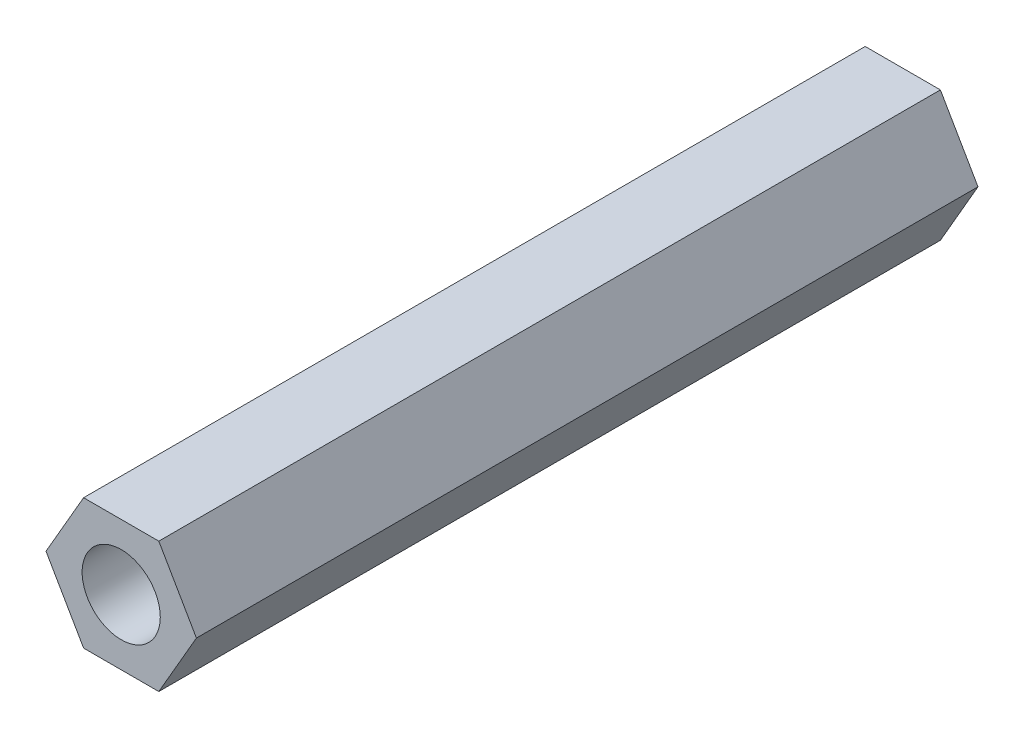
ISO-10303-21;
HEADER;
FILE_DESCRIPTION(('STEP AP214'),'2;1');
FILE_NAME('part.step','',(''),(''),'','','');
FILE_SCHEMA(('AUTOMOTIVE_DESIGN { 1 0 10303 214 1 1 1 1 }'));
ENDSEC;
DATA;
#1=APPLICATION_CONTEXT('core data for automotive mechanical design processes');
#2=APPLICATION_PROTOCOL_DEFINITION('international standard','automotive_design',2000,#1);
#3=PRODUCT_CONTEXT('',#1,'mechanical');
#4=PRODUCT('Part','Part','',(#3));
#5=PRODUCT_RELATED_PRODUCT_CATEGORY('part','',(#4));
#6=PRODUCT_DEFINITION_FORMATION('','',#4);
#7=PRODUCT_DEFINITION_CONTEXT('part definition',#1,'design');
#8=PRODUCT_DEFINITION('design','',#6,#7);
#9=PRODUCT_DEFINITION_SHAPE('','',#8);
#10=(LENGTH_UNIT() NAMED_UNIT(*) SI_UNIT(.MILLI.,.METRE.));
#11=(NAMED_UNIT(*) PLANE_ANGLE_UNIT() SI_UNIT($,.RADIAN.));
#12=(NAMED_UNIT(*) SI_UNIT($,.STERADIAN.) SOLID_ANGLE_UNIT());
#13=UNCERTAINTY_MEASURE_WITH_UNIT(LENGTH_MEASURE(1.E-05),#10,'distance_accuracy_value','');
#14=(GEOMETRIC_REPRESENTATION_CONTEXT(3) GLOBAL_UNCERTAINTY_ASSIGNED_CONTEXT((#13)) GLOBAL_UNIT_ASSIGNED_CONTEXT((#10,
#11,#12)) REPRESENTATION_CONTEXT('',''));
#15=CARTESIAN_POINT('',(0.,0.,0.));
#16=DIRECTION('',(0.,0.,1.));
#17=DIRECTION('',(1.,0.,0.));
#18=AXIS2_PLACEMENT_3D('',#15,#16,#17);
#19=CARTESIAN_POINT('',(0.,0.,30.));
#20=DIRECTION('',(0.,0.,1.));
#21=DIRECTION('',(1.,0.,0.));
#22=AXIS2_PLACEMENT_3D('',#19,#20,#21);
#23=PLANE('',#22);
#24=DIRECTION('',(1.,0.,0.));
#25=VECTOR('',#24,1.);
#26=CARTESIAN_POINT('',(-1.44337567297406,-2.5,30.));
#27=LINE('',#26,#25);
#28=CARTESIAN_POINT('',(-1.44337567297406,-2.5,30.));
#29=VERTEX_POINT('',#28);
#30=CARTESIAN_POINT('',(1.44337567297406,-2.5,30.));
#31=VERTEX_POINT('',#30);
#32=EDGE_CURVE('E131',#29,#31,#27,.T.);
#33=ORIENTED_EDGE('',*,*,#32,.T.);
#34=DIRECTION('',(0.5,0.866025403784439,0.));
#35=VECTOR('',#34,1.);
#36=CARTESIAN_POINT('',(1.44337567297406,-2.5,30.));
#37=LINE('',#36,#35);
#38=CARTESIAN_POINT('',(2.88675134594813,0.,30.));
#39=VERTEX_POINT('',#38);
#40=EDGE_CURVE('E89',#31,#39,#37,.T.);
#41=ORIENTED_EDGE('',*,*,#40,.T.);
#42=DIRECTION('',(-0.5,0.866025403784439,0.));
#43=VECTOR('',#42,1.);
#44=CARTESIAN_POINT('',(2.88675134594813,0.,30.));
#45=LINE('',#44,#43);
#46=CARTESIAN_POINT('',(1.44337567297407,2.5,30.));
#47=VERTEX_POINT('',#46);
#48=EDGE_CURVE('E102',#39,#47,#45,.T.);
#49=ORIENTED_EDGE('',*,*,#48,.T.);
#50=DIRECTION('',(-1.,0.,0.));
#51=VECTOR('',#50,1.);
#52=CARTESIAN_POINT('',(1.44337567297407,2.5,30.));
#53=LINE('',#52,#51);
#54=CARTESIAN_POINT('',(-1.44337567297406,2.5,30.));
#55=VERTEX_POINT('',#54);
#56=EDGE_CURVE('E96',#47,#55,#53,.T.);
#57=ORIENTED_EDGE('',*,*,#56,.T.);
#58=DIRECTION('',(-0.5,-0.866025403784439,0.));
#59=VECTOR('',#58,1.);
#60=CARTESIAN_POINT('',(-1.44337567297406,2.5,30.));
#61=LINE('',#60,#59);
#62=CARTESIAN_POINT('',(-2.88675134594813,0.,30.));
#63=VERTEX_POINT('',#62);
#64=EDGE_CURVE('E100',#55,#63,#61,.T.);
#65=ORIENTED_EDGE('',*,*,#64,.T.);
#66=DIRECTION('',(0.5,-0.866025403784439,0.));
#67=VECTOR('',#66,1.);
#68=CARTESIAN_POINT('',(-2.88675134594813,0.,30.));
#69=LINE('',#68,#67);
#70=EDGE_CURVE('E52',#63,#29,#69,.T.);
#71=ORIENTED_EDGE('',*,*,#70,.T.);
#72=EDGE_LOOP('',(#33,#41,#49,#57,#65,#71));
#73=FACE_BOUND('',#72,.T.);
#74=CARTESIAN_POINT('',(0.,0.,30.));
#75=DIRECTION('',(0.,0.,1.));
#76=DIRECTION('',(1.,0.,0.));
#77=AXIS2_PLACEMENT_3D('',#74,#75,#76);
#78=CIRCLE('',#77,1.5);
#79=CARTESIAN_POINT('',(1.5,0.,30.));
#80=VERTEX_POINT('',#79);
#81=EDGE_CURVE('E124',#80,#80,#78,.T.);
#82=ORIENTED_EDGE('',*,*,#81,.F.);
#83=EDGE_LOOP('',(#82));
#84=FACE_BOUND('',#83,.T.);
#85=ADVANCED_FACE('F35',(#73,#84),#23,.T.);
#86=CARTESIAN_POINT('',(0.,0.,0.));
#87=DIRECTION('',(0.,0.,1.));
#88=DIRECTION('',(1.,0.,0.));
#89=AXIS2_PLACEMENT_3D('',#86,#87,#88);
#90=PLANE('',#89);
#91=DIRECTION('',(1.,0.,0.));
#92=VECTOR('',#91,1.);
#93=CARTESIAN_POINT('',(-1.44337567297406,-2.5,0.));
#94=LINE('',#93,#92);
#95=CARTESIAN_POINT('',(-1.44337567297406,-2.5,0.));
#96=VERTEX_POINT('',#95);
#97=CARTESIAN_POINT('',(1.44337567297406,-2.5,0.));
#98=VERTEX_POINT('',#97);
#99=EDGE_CURVE('E120',#96,#98,#94,.T.);
#100=ORIENTED_EDGE('',*,*,#99,.F.);
#101=DIRECTION('',(0.5,-0.866025403784439,0.));
#102=VECTOR('',#101,1.);
#103=CARTESIAN_POINT('',(-2.88675134594813,0.,0.));
#104=LINE('',#103,#102);
#105=CARTESIAN_POINT('',(-2.88675134594813,0.,0.));
#106=VERTEX_POINT('',#105);
#107=EDGE_CURVE('E81',#106,#96,#104,.T.);
#108=ORIENTED_EDGE('',*,*,#107,.F.);
#109=DIRECTION('',(-0.5,-0.866025403784439,0.));
#110=VECTOR('',#109,1.);
#111=CARTESIAN_POINT('',(-1.44337567297406,2.5,0.));
#112=LINE('',#111,#110);
#113=CARTESIAN_POINT('',(-1.44337567297406,2.5,0.));
#114=VERTEX_POINT('',#113);
#115=EDGE_CURVE('E75',#114,#106,#112,.T.);
#116=ORIENTED_EDGE('',*,*,#115,.F.);
#117=DIRECTION('',(-1.,0.,0.));
#118=VECTOR('',#117,1.);
#119=CARTESIAN_POINT('',(1.44337567297407,2.5,0.));
#120=LINE('',#119,#118);
#121=CARTESIAN_POINT('',(1.44337567297407,2.5,0.));
#122=VERTEX_POINT('',#121);
#123=EDGE_CURVE('E110',#122,#114,#120,.T.);
#124=ORIENTED_EDGE('',*,*,#123,.F.);
#125=DIRECTION('',(-0.5,0.866025403784439,0.));
#126=VECTOR('',#125,1.);
#127=CARTESIAN_POINT('',(2.88675134594813,0.,0.));
#128=LINE('',#127,#126);
#129=CARTESIAN_POINT('',(2.88675134594813,0.,0.));
#130=VERTEX_POINT('',#129);
#131=EDGE_CURVE('E126',#130,#122,#128,.T.);
#132=ORIENTED_EDGE('',*,*,#131,.F.);
#133=DIRECTION('',(0.5,0.866025403784439,0.));
#134=VECTOR('',#133,1.);
#135=CARTESIAN_POINT('',(1.44337567297406,-2.5,0.));
#136=LINE('',#135,#134);
#137=EDGE_CURVE('E123',#98,#130,#136,.T.);
#138=ORIENTED_EDGE('',*,*,#137,.F.);
#139=EDGE_LOOP('',(#100,#108,#116,#124,#132,#138));
#140=FACE_BOUND('',#139,.T.);
#141=CARTESIAN_POINT('',(0.,0.,0.));
#142=DIRECTION('',(0.,0.,1.));
#143=DIRECTION('',(1.,0.,0.));
#144=AXIS2_PLACEMENT_3D('',#141,#142,#143);
#145=CIRCLE('',#144,1.5);
#146=CARTESIAN_POINT('',(1.5,0.,0.));
#147=VERTEX_POINT('',#146);
#148=EDGE_CURVE('E224',#147,#147,#145,.T.);
#149=ORIENTED_EDGE('',*,*,#148,.T.);
#150=EDGE_LOOP('',(#149));
#151=FACE_BOUND('',#150,.T.);
#152=ADVANCED_FACE('F140',(#140,#151),#90,.F.);
#153=CARTESIAN_POINT('',(-1.44337567297406,-2.5,30.));
#154=DIRECTION('',(0.,1.,0.));
#155=DIRECTION('',(-1.,0.,0.));
#156=AXIS2_PLACEMENT_3D('',#153,#154,#155);
#157=PLANE('',#156);
#158=ORIENTED_EDGE('',*,*,#99,.T.);
#159=DIRECTION('',(0.,0.,-1.));
#160=VECTOR('',#159,1.);
#161=CARTESIAN_POINT('',(1.44337567297406,-2.5,30.));
#162=LINE('',#161,#160);
#163=EDGE_CURVE('E11',#31,#98,#162,.T.);
#164=ORIENTED_EDGE('',*,*,#163,.F.);
#165=ORIENTED_EDGE('',*,*,#32,.F.);
#166=DIRECTION('',(0.,0.,-1.));
#167=VECTOR('',#166,1.);
#168=CARTESIAN_POINT('',(-1.44337567297406,-2.5,30.));
#169=LINE('',#168,#167);
#170=EDGE_CURVE('E116',#29,#96,#169,.T.);
#171=ORIENTED_EDGE('',*,*,#170,.T.);
#172=EDGE_LOOP('',(#158,#164,#165,#171));
#173=FACE_BOUND('',#172,.T.);
#174=ADVANCED_FACE('F37',(#173),#157,.F.);
#175=CARTESIAN_POINT('',(1.44337567297406,-2.5,30.));
#176=DIRECTION('',(-0.866025403784439,0.5,0.));
#177=DIRECTION('',(-0.5,-0.866025403784439,0.));
#178=AXIS2_PLACEMENT_3D('',#175,#176,#177);
#179=PLANE('',#178);
#180=ORIENTED_EDGE('',*,*,#137,.T.);
#181=DIRECTION('',(0.,0.,-1.));
#182=VECTOR('',#181,1.);
#183=CARTESIAN_POINT('',(2.88675134594813,0.,30.));
#184=LINE('',#183,#182);
#185=EDGE_CURVE('E44',#39,#130,#184,.T.);
#186=ORIENTED_EDGE('',*,*,#185,.F.);
#187=ORIENTED_EDGE('',*,*,#40,.F.);
#188=ORIENTED_EDGE('',*,*,#163,.T.);
#189=EDGE_LOOP('',(#180,#186,#187,#188));
#190=FACE_BOUND('',#189,.T.);
#191=ADVANCED_FACE('F165',(#190),#179,.F.);
#192=CARTESIAN_POINT('',(2.88675134594813,0.,30.));
#193=DIRECTION('',(-0.866025403784439,-0.5,0.));
#194=DIRECTION('',(0.5,-0.866025403784439,0.));
#195=AXIS2_PLACEMENT_3D('',#192,#193,#194);
#196=PLANE('',#195);
#197=ORIENTED_EDGE('',*,*,#131,.T.);
#198=DIRECTION('',(0.,0.,-1.));
#199=VECTOR('',#198,1.);
#200=CARTESIAN_POINT('',(1.44337567297407,2.5,30.));
#201=LINE('',#200,#199);
#202=EDGE_CURVE('E111',#47,#122,#201,.T.);
#203=ORIENTED_EDGE('',*,*,#202,.F.);
#204=ORIENTED_EDGE('',*,*,#48,.F.);
#205=ORIENTED_EDGE('',*,*,#185,.T.);
#206=EDGE_LOOP('',(#197,#203,#204,#205));
#207=FACE_BOUND('',#206,.T.);
#208=ADVANCED_FACE('F137',(#207),#196,.F.);
#209=CARTESIAN_POINT('',(1.44337567297407,2.5,30.));
#210=DIRECTION('',(0.,-1.,0.));
#211=DIRECTION('',(0.,0.,-1.));
#212=AXIS2_PLACEMENT_3D('',#209,#210,#211);
#213=PLANE('',#212);
#214=ORIENTED_EDGE('',*,*,#123,.T.);
#215=DIRECTION('',(0.,0.,-1.));
#216=VECTOR('',#215,1.);
#217=CARTESIAN_POINT('',(-1.44337567297406,2.5,30.));
#218=LINE('',#217,#216);
#219=EDGE_CURVE('E107',#55,#114,#218,.T.);
#220=ORIENTED_EDGE('',*,*,#219,.F.);
#221=ORIENTED_EDGE('',*,*,#56,.F.);
#222=ORIENTED_EDGE('',*,*,#202,.T.);
#223=EDGE_LOOP('',(#214,#220,#221,#222));
#224=FACE_BOUND('',#223,.T.);
#225=ADVANCED_FACE('F108',(#224),#213,.F.);
#226=CARTESIAN_POINT('',(-1.44337567297406,2.5,30.));
#227=DIRECTION('',(0.866025403784439,-0.5,0.));
#228=DIRECTION('',(0.5,0.866025403784439,0.));
#229=AXIS2_PLACEMENT_3D('',#226,#227,#228);
#230=PLANE('',#229);
#231=ORIENTED_EDGE('',*,*,#115,.T.);
#232=DIRECTION('',(0.,0.,-1.));
#233=VECTOR('',#232,1.);
#234=CARTESIAN_POINT('',(-2.88675134594813,0.,30.));
#235=LINE('',#234,#233);
#236=EDGE_CURVE('E112',#63,#106,#235,.T.);
#237=ORIENTED_EDGE('',*,*,#236,.F.);
#238=ORIENTED_EDGE('',*,*,#64,.F.);
#239=ORIENTED_EDGE('',*,*,#219,.T.);
#240=EDGE_LOOP('',(#231,#237,#238,#239));
#241=FACE_BOUND('',#240,.T.);
#242=ADVANCED_FACE('F114',(#241),#230,.F.);
#243=CARTESIAN_POINT('',(-2.88675134594813,0.,30.));
#244=DIRECTION('',(0.866025403784439,0.5,0.));
#245=DIRECTION('',(-0.5,0.866025403784439,0.));
#246=AXIS2_PLACEMENT_3D('',#243,#244,#245);
#247=PLANE('',#246);
#248=ORIENTED_EDGE('',*,*,#107,.T.);
#249=ORIENTED_EDGE('',*,*,#170,.F.);
#250=ORIENTED_EDGE('',*,*,#70,.F.);
#251=ORIENTED_EDGE('',*,*,#236,.T.);
#252=EDGE_LOOP('',(#248,#249,#250,#251));
#253=FACE_BOUND('',#252,.T.);
#254=ADVANCED_FACE('F145',(#253),#247,.F.);
#255=CARTESIAN_POINT('',(0.,0.,30.));
#256=DIRECTION('',(0.,0.,-1.));
#257=DIRECTION('',(-1.,0.,0.));
#258=AXIS2_PLACEMENT_3D('',#255,#256,#257);
#259=CYLINDRICAL_SURFACE('',#258,1.5);
#260=ORIENTED_EDGE('',*,*,#81,.T.);
#261=EDGE_LOOP('',(#260));
#262=FACE_BOUND('',#261,.T.);
#263=ORIENTED_EDGE('',*,*,#148,.F.);
#264=EDGE_LOOP('',(#263));
#265=FACE_BOUND('',#264,.T.);
#266=ADVANCED_FACE('F147',(#262,#265),#259,.F.);
#267=CLOSED_SHELL('',(#85,#152,#174,#191,#208,#225,#242,#254,#266));
#268=MANIFOLD_SOLID_BREP('B2',#267);
#269=ADVANCED_BREP_SHAPE_REPRESENTATION('',(#18,#268),#14);
#270=SHAPE_DEFINITION_REPRESENTATION(#9,#269);
ENDSEC;
END-ISO-10303-21;
